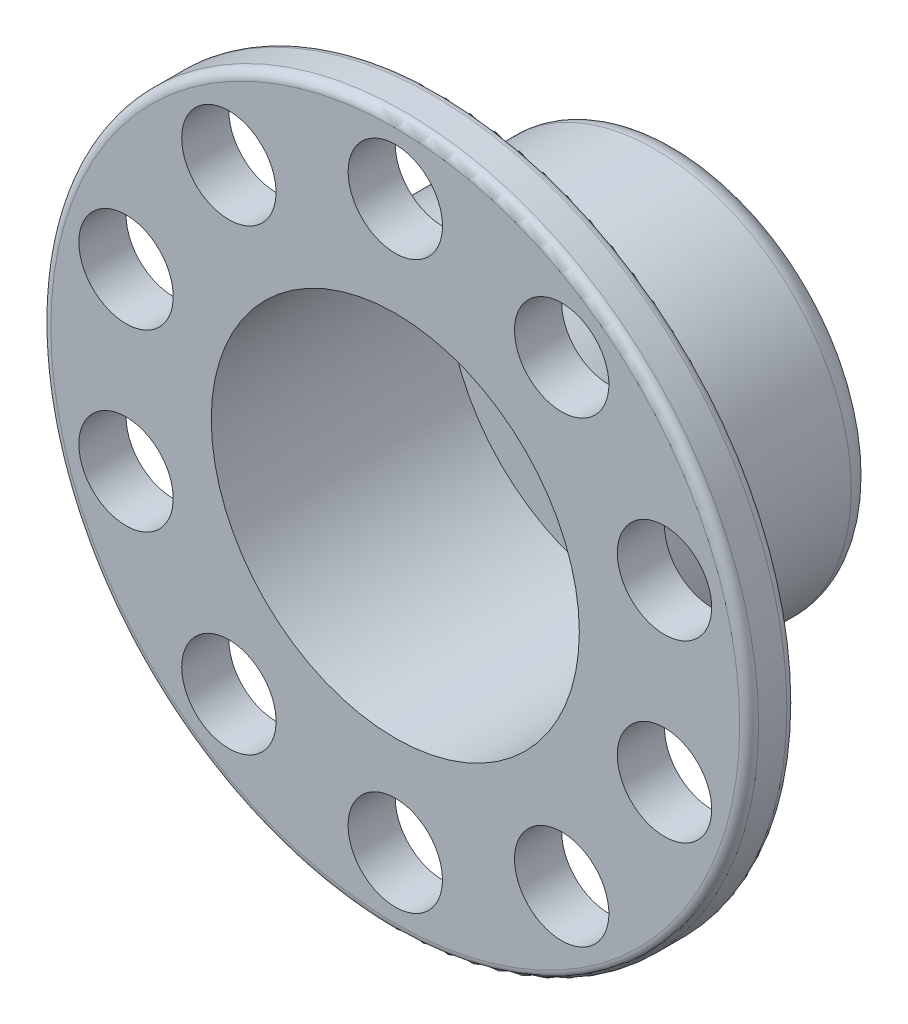
ISO-10303-21;
HEADER;
FILE_DESCRIPTION(('STEP AP214'),'2;1');
FILE_NAME('part.step','',(''),(''),'','','');
FILE_SCHEMA(('AUTOMOTIVE_DESIGN { 1 0 10303 214 1 1 1 1 }'));
ENDSEC;
DATA;
#1=APPLICATION_CONTEXT('core data for automotive mechanical design processes');
#2=APPLICATION_PROTOCOL_DEFINITION('international standard','automotive_design',2000,#1);
#3=PRODUCT_CONTEXT('',#1,'mechanical');
#4=PRODUCT('Part','Part','',(#3));
#5=PRODUCT_RELATED_PRODUCT_CATEGORY('part','',(#4));
#6=PRODUCT_DEFINITION_FORMATION('','',#4);
#7=PRODUCT_DEFINITION_CONTEXT('part definition',#1,'design');
#8=PRODUCT_DEFINITION('design','',#6,#7);
#9=PRODUCT_DEFINITION_SHAPE('','',#8);
#10=(LENGTH_UNIT() NAMED_UNIT(*) SI_UNIT(.MILLI.,.METRE.));
#11=(NAMED_UNIT(*) PLANE_ANGLE_UNIT() SI_UNIT($,.RADIAN.));
#12=(NAMED_UNIT(*) SI_UNIT($,.STERADIAN.) SOLID_ANGLE_UNIT());
#13=UNCERTAINTY_MEASURE_WITH_UNIT(LENGTH_MEASURE(1.E-05),#10,'distance_accuracy_value','');
#14=(GEOMETRIC_REPRESENTATION_CONTEXT(3) GLOBAL_UNCERTAINTY_ASSIGNED_CONTEXT((#13)) GLOBAL_UNIT_ASSIGNED_CONTEXT((#10,
#11,#12)) REPRESENTATION_CONTEXT('',''));
#15=CARTESIAN_POINT('',(0.,0.,0.));
#16=DIRECTION('',(0.,0.,1.));
#17=DIRECTION('',(1.,0.,0.));
#18=AXIS2_PLACEMENT_3D('',#15,#16,#17);
#19=CARTESIAN_POINT('',(0.,0.,-50.));
#20=DIRECTION('',(0.,0.,1.));
#21=DIRECTION('',(1.,0.,0.));
#22=AXIS2_PLACEMENT_3D('',#19,#20,#21);
#23=CYLINDRICAL_SURFACE('',#22,39.005);
#24=CARTESIAN_POINT('',(0.,0.,10.));
#25=DIRECTION('',(0.,0.,1.));
#26=DIRECTION('',(1.,0.,0.));
#27=AXIS2_PLACEMENT_3D('',#24,#25,#26);
#28=CIRCLE('',#27,39.005);
#29=CARTESIAN_POINT('',(39.005,0.,10.));
#30=VERTEX_POINT('',#29);
#31=EDGE_CURVE('E89',#30,#30,#28,.T.);
#32=ORIENTED_EDGE('',*,*,#31,.T.);
#33=EDGE_LOOP('',(#32));
#34=FACE_BOUND('',#33,.T.);
#35=CARTESIAN_POINT('',(0.,0.,-40.));
#36=DIRECTION('',(0.,0.,-1.));
#37=DIRECTION('',(-1.,0.,0.));
#38=AXIS2_PLACEMENT_3D('',#35,#36,#37);
#39=CIRCLE('',#38,39.005);
#40=CARTESIAN_POINT('',(-39.005,0.,-40.));
#41=VERTEX_POINT('',#40);
#42=EDGE_CURVE('E81',#41,#41,#39,.F.);
#43=ORIENTED_EDGE('',*,*,#42,.F.);
#44=EDGE_LOOP('',(#43));
#45=FACE_BOUND('',#44,.T.);
#46=ADVANCED_FACE('F49',(#34,#45),#23,.F.);
#47=CARTESIAN_POINT('',(0.,0.,10.));
#48=DIRECTION('',(0.,0.,1.));
#49=DIRECTION('',(1.,0.,0.));
#50=AXIS2_PLACEMENT_3D('',#47,#48,#49);
#51=PLANE('',#50);
#52=CARTESIAN_POINT('',(0.,0.,10.));
#53=DIRECTION('',(0.,0.,1.));
#54=DIRECTION('',(1.,0.,0.));
#55=AXIS2_PLACEMENT_3D('',#52,#53,#54);
#56=CIRCLE('',#55,73.);
#57=CARTESIAN_POINT('',(73.,0.,10.));
#58=VERTEX_POINT('',#57);
#59=EDGE_CURVE('E11',#58,#58,#56,.T.);
#60=ORIENTED_EDGE('',*,*,#59,.T.);
#61=EDGE_LOOP('',(#60));
#62=FACE_BOUND('',#61,.T.);
#63=CARTESIAN_POINT('',(-35.2671151375489,48.5410196624983,10.));
#64=DIRECTION('',(0.,0.,-1.));
#65=DIRECTION('',(-1.,0.,0.));
#66=AXIS2_PLACEMENT_3D('',#63,#64,#65);
#67=CIRCLE('',#66,10.0000000000001);
#68=CARTESIAN_POINT('',(-45.267115137549,48.5410196624983,10.));
#69=VERTEX_POINT('',#68);
#70=EDGE_CURVE('E98',#69,#69,#67,.T.);
#71=ORIENTED_EDGE('',*,*,#70,.T.);
#72=EDGE_LOOP('',(#71));
#73=FACE_BOUND('',#72,.T.);
#74=CARTESIAN_POINT('',(-57.063390977711,18.5410196624993,10.));
#75=DIRECTION('',(0.,0.,-1.));
#76=DIRECTION('',(-1.,0.,0.));
#77=AXIS2_PLACEMENT_3D('',#74,#75,#76);
#78=CIRCLE('',#77,10.0000000000011);
#79=CARTESIAN_POINT('',(-67.0633909777121,18.5410196624993,10.));
#80=VERTEX_POINT('',#79);
#81=EDGE_CURVE('E155',#80,#80,#78,.T.);
#82=ORIENTED_EDGE('',*,*,#81,.T.);
#83=EDGE_LOOP('',(#82));
#84=FACE_BOUND('',#83,.T.);
#85=CARTESIAN_POINT('',(-57.0633909777126,-18.5410196624944,10.));
#86=DIRECTION('',(0.,0.,-1.));
#87=DIRECTION('',(-1.,0.,0.));
#88=AXIS2_PLACEMENT_3D('',#85,#86,#87);
#89=CIRCLE('',#88,10.0000000000027);
#90=CARTESIAN_POINT('',(-67.0633909777153,-18.5410196624944,10.));
#91=VERTEX_POINT('',#90);
#92=EDGE_CURVE('E147',#91,#91,#89,.T.);
#93=ORIENTED_EDGE('',*,*,#92,.T.);
#94=EDGE_LOOP('',(#93));
#95=FACE_BOUND('',#94,.T.);
#96=CARTESIAN_POINT('',(-35.267115137553,-48.5410196624953,10.));
#97=DIRECTION('',(0.,0.,-1.));
#98=DIRECTION('',(-1.,0.,0.));
#99=AXIS2_PLACEMENT_3D('',#96,#97,#98);
#100=CIRCLE('',#99,10.0000000000043);
#101=CARTESIAN_POINT('',(-45.2671151375573,-48.5410196624953,10.));
#102=VERTEX_POINT('',#101);
#103=EDGE_CURVE('E139',#102,#102,#100,.T.);
#104=ORIENTED_EDGE('',*,*,#103,.T.);
#105=EDGE_LOOP('',(#104));
#106=FACE_BOUND('',#105,.T.);
#107=CARTESIAN_POINT('',(-5.10121193588295E-12,-60.,10.));
#108=DIRECTION('',(0.,0.,-1.));
#109=DIRECTION('',(-1.,0.,0.));
#110=AXIS2_PLACEMENT_3D('',#107,#108,#109);
#111=CIRCLE('',#110,10.0000000000053);
#112=CARTESIAN_POINT('',(-10.0000000000104,-60.,10.));
#113=VERTEX_POINT('',#112);
#114=EDGE_CURVE('E131',#113,#113,#111,.T.);
#115=ORIENTED_EDGE('',*,*,#114,.T.);
#116=EDGE_LOOP('',(#115));
#117=FACE_BOUND('',#116,.T.);
#118=CARTESIAN_POINT('',(35.2671151375438,-48.5410196624983,10.));
#119=DIRECTION('',(0.,0.,-1.));
#120=DIRECTION('',(-1.,0.,0.));
#121=AXIS2_PLACEMENT_3D('',#118,#119,#120);
#122=CIRCLE('',#121,10.0000000000054);
#123=CARTESIAN_POINT('',(25.2671151375384,-48.5410196624983,10.));
#124=VERTEX_POINT('',#123);
#125=EDGE_CURVE('E123',#124,#124,#122,.T.);
#126=ORIENTED_EDGE('',*,*,#125,.T.);
#127=EDGE_LOOP('',(#126));
#128=FACE_BOUND('',#127,.T.);
#129=CARTESIAN_POINT('',(57.0633909777059,-18.5410196624993,10.));
#130=DIRECTION('',(0.,0.,-1.));
#131=DIRECTION('',(-1.,0.,0.));
#132=AXIS2_PLACEMENT_3D('',#129,#130,#131);
#133=CIRCLE('',#132,10.0000000000044);
#134=CARTESIAN_POINT('',(47.0633909777014,-18.5410196624993,10.));
#135=VERTEX_POINT('',#134);
#136=EDGE_CURVE('E115',#135,#135,#133,.T.);
#137=ORIENTED_EDGE('',*,*,#136,.T.);
#138=EDGE_LOOP('',(#137));
#139=FACE_BOUND('',#138,.T.);
#140=CARTESIAN_POINT('',(57.0633909777075,18.5410196624944,10.));
#141=DIRECTION('',(0.,0.,-1.));
#142=DIRECTION('',(-1.,0.,0.));
#143=AXIS2_PLACEMENT_3D('',#140,#141,#142);
#144=CIRCLE('',#143,10.0000000000031);
#145=CARTESIAN_POINT('',(47.0633909777044,18.5410196624944,10.));
#146=VERTEX_POINT('',#145);
#147=EDGE_CURVE('E106',#146,#146,#144,.T.);
#148=ORIENTED_EDGE('',*,*,#147,.T.);
#149=EDGE_LOOP('',(#148));
#150=FACE_BOUND('',#149,.T.);
#151=CARTESIAN_POINT('',(35.2671151375479,48.5410196624953,10.));
#152=DIRECTION('',(0.,0.,-1.));
#153=DIRECTION('',(-1.,0.,0.));
#154=AXIS2_PLACEMENT_3D('',#151,#152,#153);
#155=CIRCLE('',#154,10.0000000000017);
#156=CARTESIAN_POINT('',(25.2671151375462,48.5410196624953,10.));
#157=VERTEX_POINT('',#156);
#158=EDGE_CURVE('E107',#157,#157,#155,.T.);
#159=ORIENTED_EDGE('',*,*,#158,.T.);
#160=EDGE_LOOP('',(#159));
#161=FACE_BOUND('',#160,.T.);
#162=CARTESIAN_POINT('',(0.,60.,10.));
#163=DIRECTION('',(0.,0.,-1.));
#164=DIRECTION('',(-1.,0.,0.));
#165=AXIS2_PLACEMENT_3D('',#162,#163,#164);
#166=CIRCLE('',#165,10.);
#167=CARTESIAN_POINT('',(-10.,60.,10.));
#168=VERTEX_POINT('',#167);
#169=EDGE_CURVE('E93',#168,#168,#166,.T.);
#170=ORIENTED_EDGE('',*,*,#169,.T.);
#171=EDGE_LOOP('',(#170));
#172=FACE_BOUND('',#171,.T.);
#173=ORIENTED_EDGE('',*,*,#31,.F.);
#174=EDGE_LOOP('',(#173));
#175=FACE_BOUND('',#174,.T.);
#176=ADVANCED_FACE('F174',(#62,#73,#84,#95,#106,#117,#128,#139,#150,#161,#172,#175),#51,.T.);
#177=CARTESIAN_POINT('',(0.,0.,0.));
#178=DIRECTION('',(0.,0.,1.));
#179=DIRECTION('',(1.,0.,0.));
#180=AXIS2_PLACEMENT_3D('',#177,#178,#179);
#181=PLANE('',#180);
#182=CARTESIAN_POINT('',(0.,0.,0.));
#183=DIRECTION('',(0.,0.,1.));
#184=DIRECTION('',(1.,0.,0.));
#185=AXIS2_PLACEMENT_3D('',#182,#183,#184);
#186=CIRCLE('',#185,73.);
#187=CARTESIAN_POINT('',(73.,0.,0.));
#188=VERTEX_POINT('',#187);
#189=EDGE_CURVE('E57',#188,#188,#186,.F.);
#190=ORIENTED_EDGE('',*,*,#189,.T.);
#191=EDGE_LOOP('',(#190));
#192=FACE_BOUND('',#191,.T.);
#193=CARTESIAN_POINT('',(-35.2671151375489,48.5410196624983,0.));
#194=DIRECTION('',(0.,0.,-1.));
#195=DIRECTION('',(-1.,0.,0.));
#196=AXIS2_PLACEMENT_3D('',#193,#194,#195);
#197=CIRCLE('',#196,10.0000000000001);
#198=CARTESIAN_POINT('',(-45.267115137549,48.5410196624983,0.));
#199=VERTEX_POINT('',#198);
#200=EDGE_CURVE('E159',#199,#199,#197,.T.);
#201=ORIENTED_EDGE('',*,*,#200,.F.);
#202=EDGE_LOOP('',(#201));
#203=FACE_BOUND('',#202,.T.);
#204=CARTESIAN_POINT('',(-57.063390977711,18.5410196624993,0.));
#205=DIRECTION('',(0.,0.,-1.));
#206=DIRECTION('',(-1.,0.,0.));
#207=AXIS2_PLACEMENT_3D('',#204,#205,#206);
#208=CIRCLE('',#207,10.0000000000011);
#209=CARTESIAN_POINT('',(-67.0633909777121,18.5410196624993,0.));
#210=VERTEX_POINT('',#209);
#211=EDGE_CURVE('E151',#210,#210,#208,.T.);
#212=ORIENTED_EDGE('',*,*,#211,.F.);
#213=EDGE_LOOP('',(#212));
#214=FACE_BOUND('',#213,.T.);
#215=CARTESIAN_POINT('',(-57.0633909777126,-18.5410196624944,0.));
#216=DIRECTION('',(0.,0.,-1.));
#217=DIRECTION('',(-1.,0.,0.));
#218=AXIS2_PLACEMENT_3D('',#215,#216,#217);
#219=CIRCLE('',#218,10.0000000000027);
#220=CARTESIAN_POINT('',(-67.0633909777153,-18.5410196624944,0.));
#221=VERTEX_POINT('',#220);
#222=EDGE_CURVE('E143',#221,#221,#219,.T.);
#223=ORIENTED_EDGE('',*,*,#222,.F.);
#224=EDGE_LOOP('',(#223));
#225=FACE_BOUND('',#224,.T.);
#226=CARTESIAN_POINT('',(-35.267115137553,-48.5410196624953,0.));
#227=DIRECTION('',(0.,0.,-1.));
#228=DIRECTION('',(-1.,0.,0.));
#229=AXIS2_PLACEMENT_3D('',#226,#227,#228);
#230=CIRCLE('',#229,10.0000000000043);
#231=CARTESIAN_POINT('',(-45.2671151375573,-48.5410196624953,0.));
#232=VERTEX_POINT('',#231);
#233=EDGE_CURVE('E135',#232,#232,#230,.T.);
#234=ORIENTED_EDGE('',*,*,#233,.F.);
#235=EDGE_LOOP('',(#234));
#236=FACE_BOUND('',#235,.T.);
#237=CARTESIAN_POINT('',(-5.10121193588295E-12,-60.,0.));
#238=DIRECTION('',(0.,0.,-1.));
#239=DIRECTION('',(-1.,0.,0.));
#240=AXIS2_PLACEMENT_3D('',#237,#238,#239);
#241=CIRCLE('',#240,10.0000000000053);
#242=CARTESIAN_POINT('',(-10.0000000000104,-60.,0.));
#243=VERTEX_POINT('',#242);
#244=EDGE_CURVE('E127',#243,#243,#241,.T.);
#245=ORIENTED_EDGE('',*,*,#244,.F.);
#246=EDGE_LOOP('',(#245));
#247=FACE_BOUND('',#246,.T.);
#248=CARTESIAN_POINT('',(35.2671151375438,-48.5410196624983,0.));
#249=DIRECTION('',(0.,0.,-1.));
#250=DIRECTION('',(-1.,0.,0.));
#251=AXIS2_PLACEMENT_3D('',#248,#249,#250);
#252=CIRCLE('',#251,10.0000000000054);
#253=CARTESIAN_POINT('',(25.2671151375384,-48.5410196624983,0.));
#254=VERTEX_POINT('',#253);
#255=EDGE_CURVE('E119',#254,#254,#252,.T.);
#256=ORIENTED_EDGE('',*,*,#255,.F.);
#257=EDGE_LOOP('',(#256));
#258=FACE_BOUND('',#257,.T.);
#259=CARTESIAN_POINT('',(57.0633909777059,-18.5410196624993,0.));
#260=DIRECTION('',(0.,0.,-1.));
#261=DIRECTION('',(-1.,0.,0.));
#262=AXIS2_PLACEMENT_3D('',#259,#260,#261);
#263=CIRCLE('',#262,10.0000000000044);
#264=CARTESIAN_POINT('',(47.0633909777014,-18.5410196624993,0.));
#265=VERTEX_POINT('',#264);
#266=EDGE_CURVE('E111',#265,#265,#263,.T.);
#267=ORIENTED_EDGE('',*,*,#266,.F.);
#268=EDGE_LOOP('',(#267));
#269=FACE_BOUND('',#268,.T.);
#270=CARTESIAN_POINT('',(57.0633909777075,18.5410196624944,0.));
#271=DIRECTION('',(0.,0.,-1.));
#272=DIRECTION('',(-1.,0.,0.));
#273=AXIS2_PLACEMENT_3D('',#270,#271,#272);
#274=CIRCLE('',#273,10.0000000000031);
#275=CARTESIAN_POINT('',(47.0633909777044,18.5410196624944,0.));
#276=VERTEX_POINT('',#275);
#277=EDGE_CURVE('E102',#276,#276,#274,.T.);
#278=ORIENTED_EDGE('',*,*,#277,.F.);
#279=EDGE_LOOP('',(#278));
#280=FACE_BOUND('',#279,.T.);
#281=CARTESIAN_POINT('',(35.2671151375479,48.5410196624953,0.));
#282=DIRECTION('',(0.,0.,-1.));
#283=DIRECTION('',(-1.,0.,0.));
#284=AXIS2_PLACEMENT_3D('',#281,#282,#283);
#285=CIRCLE('',#284,10.0000000000017);
#286=CARTESIAN_POINT('',(25.2671151375462,48.5410196624953,0.));
#287=VERTEX_POINT('',#286);
#288=EDGE_CURVE('E166',#287,#287,#285,.T.);
#289=ORIENTED_EDGE('',*,*,#288,.F.);
#290=EDGE_LOOP('',(#289));
#291=FACE_BOUND('',#290,.T.);
#292=CARTESIAN_POINT('',(0.,60.,0.));
#293=DIRECTION('',(0.,0.,-1.));
#294=DIRECTION('',(-1.,0.,0.));
#295=AXIS2_PLACEMENT_3D('',#292,#293,#294);
#296=CIRCLE('',#295,10.);
#297=CARTESIAN_POINT('',(-10.,60.,0.));
#298=VERTEX_POINT('',#297);
#299=EDGE_CURVE('E94',#298,#298,#296,.T.);
#300=ORIENTED_EDGE('',*,*,#299,.F.);
#301=EDGE_LOOP('',(#300));
#302=FACE_BOUND('',#301,.T.);
#303=CARTESIAN_POINT('',(0.,0.,0.));
#304=DIRECTION('',(0.,0.,1.));
#305=DIRECTION('',(1.,0.,0.));
#306=AXIS2_PLACEMENT_3D('',#303,#304,#305);
#307=CIRCLE('',#306,41.655);
#308=CARTESIAN_POINT('',(41.655,0.,0.));
#309=VERTEX_POINT('',#308);
#310=EDGE_CURVE('E85',#309,#309,#307,.T.);
#311=ORIENTED_EDGE('',*,*,#310,.T.);
#312=EDGE_LOOP('',(#311));
#313=FACE_BOUND('',#312,.T.);
#314=ADVANCED_FACE('F185',(#192,#203,#214,#225,#236,#247,#258,#269,#280,#291,#302,#313),#181,.F.);
#315=CARTESIAN_POINT('',(0.,0.,10.));
#316=DIRECTION('',(0.,0.,-1.));
#317=DIRECTION('',(-1.,0.,0.));
#318=AXIS2_PLACEMENT_3D('',#315,#316,#317);
#319=CYLINDRICAL_SURFACE('',#318,75.);
#320=CARTESIAN_POINT('',(0.,0.,2.));
#321=DIRECTION('',(0.,0.,1.));
#322=DIRECTION('',(1.,0.,0.));
#323=AXIS2_PLACEMENT_3D('',#320,#321,#322);
#324=CIRCLE('',#323,75.);
#325=CARTESIAN_POINT('',(75.,0.,2.));
#326=VERTEX_POINT('',#325);
#327=EDGE_CURVE('E62',#326,#326,#324,.T.);
#328=ORIENTED_EDGE('',*,*,#327,.T.);
#329=EDGE_LOOP('',(#328));
#330=FACE_BOUND('',#329,.T.);
#331=CARTESIAN_POINT('',(0.,0.,8.));
#332=DIRECTION('',(0.,0.,1.));
#333=DIRECTION('',(1.,0.,0.));
#334=AXIS2_PLACEMENT_3D('',#331,#332,#333);
#335=CIRCLE('',#334,75.);
#336=CARTESIAN_POINT('',(75.,0.,8.));
#337=VERTEX_POINT('',#336);
#338=EDGE_CURVE('E67',#337,#337,#335,.F.);
#339=ORIENTED_EDGE('',*,*,#338,.T.);
#340=EDGE_LOOP('',(#339));
#341=FACE_BOUND('',#340,.T.);
#342=ADVANCED_FACE('F188',(#330,#341),#319,.T.);
#343=CARTESIAN_POINT('',(0.,0.,-50.));
#344=DIRECTION('',(0.,0.,1.));
#345=DIRECTION('',(1.,0.,0.));
#346=AXIS2_PLACEMENT_3D('',#343,#344,#345);
#347=CYLINDRICAL_SURFACE('',#346,41.655);
#348=CARTESIAN_POINT('',(0.,0.,-45.));
#349=DIRECTION('',(0.,0.,1.));
#350=DIRECTION('',(1.,0.,0.));
#351=AXIS2_PLACEMENT_3D('',#348,#349,#350);
#352=CIRCLE('',#351,41.655);
#353=CARTESIAN_POINT('',(41.655,0.,-45.));
#354=VERTEX_POINT('',#353);
#355=EDGE_CURVE('E77',#354,#354,#352,.T.);
#356=ORIENTED_EDGE('',*,*,#355,.T.);
#357=EDGE_LOOP('',(#356));
#358=FACE_BOUND('',#357,.T.);
#359=ORIENTED_EDGE('',*,*,#310,.F.);
#360=EDGE_LOOP('',(#359));
#361=FACE_BOUND('',#360,.T.);
#362=ADVANCED_FACE('F194',(#358,#361),#347,.T.);
#363=CARTESIAN_POINT('',(0.,0.,-50.));
#364=DIRECTION('',(0.,0.,1.));
#365=DIRECTION('',(1.,0.,0.));
#366=AXIS2_PLACEMENT_3D('',#363,#364,#365);
#367=PLANE('',#366);
#368=CARTESIAN_POINT('',(0.,0.,-50.));
#369=DIRECTION('',(0.,0.,1.));
#370=DIRECTION('',(1.,0.,0.));
#371=AXIS2_PLACEMENT_3D('',#368,#369,#370);
#372=CIRCLE('',#371,36.655);
#373=CARTESIAN_POINT('',(36.655,0.,-50.));
#374=VERTEX_POINT('',#373);
#375=EDGE_CURVE('E73',#374,#374,#372,.F.);
#376=ORIENTED_EDGE('',*,*,#375,.T.);
#377=EDGE_LOOP('',(#376));
#378=FACE_BOUND('',#377,.T.);
#379=ADVANCED_FACE('F196',(#378),#367,.F.);
#380=CARTESIAN_POINT('',(0.,0.,-40.));
#381=DIRECTION('',(0.,0.,-1.));
#382=DIRECTION('',(-1.,0.,0.));
#383=AXIS2_PLACEMENT_3D('',#380,#381,#382);
#384=PLANE('',#383);
#385=ORIENTED_EDGE('',*,*,#42,.T.);
#386=EDGE_LOOP('',(#385));
#387=FACE_BOUND('',#386,.T.);
#388=ADVANCED_FACE('F203',(#387),#384,.F.);
#389=CARTESIAN_POINT('',(0.,60.,10.));
#390=DIRECTION('',(0.,0.,-1.));
#391=DIRECTION('',(-1.,0.,0.));
#392=AXIS2_PLACEMENT_3D('',#389,#390,#391);
#393=CYLINDRICAL_SURFACE('',#392,10.);
#394=ORIENTED_EDGE('',*,*,#169,.F.);
#395=EDGE_LOOP('',(#394));
#396=FACE_BOUND('',#395,.T.);
#397=ORIENTED_EDGE('',*,*,#299,.T.);
#398=EDGE_LOOP('',(#397));
#399=FACE_BOUND('',#398,.T.);
#400=ADVANCED_FACE('F181',(#396,#399),#393,.F.);
#401=CARTESIAN_POINT('',(35.2671151375479,48.5410196624953,10.));
#402=DIRECTION('',(0.,0.,-1.));
#403=DIRECTION('',(-1.,0.,0.));
#404=AXIS2_PLACEMENT_3D('',#401,#402,#403);
#405=CYLINDRICAL_SURFACE('',#404,10.0000000000017);
#406=ORIENTED_EDGE('',*,*,#158,.F.);
#407=EDGE_LOOP('',(#406));
#408=FACE_BOUND('',#407,.T.);
#409=ORIENTED_EDGE('',*,*,#288,.T.);
#410=EDGE_LOOP('',(#409));
#411=FACE_BOUND('',#410,.T.);
#412=ADVANCED_FACE('F177',(#408,#411),#405,.F.);
#413=CARTESIAN_POINT('',(57.0633909777075,18.5410196624944,10.));
#414=DIRECTION('',(0.,0.,-1.));
#415=DIRECTION('',(-1.,0.,0.));
#416=AXIS2_PLACEMENT_3D('',#413,#414,#415);
#417=CYLINDRICAL_SURFACE('',#416,10.0000000000031);
#418=ORIENTED_EDGE('',*,*,#147,.F.);
#419=EDGE_LOOP('',(#418));
#420=FACE_BOUND('',#419,.T.);
#421=ORIENTED_EDGE('',*,*,#277,.T.);
#422=EDGE_LOOP('',(#421));
#423=FACE_BOUND('',#422,.T.);
#424=ADVANCED_FACE('F180',(#420,#423),#417,.F.);
#425=CARTESIAN_POINT('',(57.0633909777059,-18.5410196624993,10.));
#426=DIRECTION('',(0.,0.,-1.));
#427=DIRECTION('',(-1.,0.,0.));
#428=AXIS2_PLACEMENT_3D('',#425,#426,#427);
#429=CYLINDRICAL_SURFACE('',#428,10.0000000000044);
#430=ORIENTED_EDGE('',*,*,#136,.F.);
#431=EDGE_LOOP('',(#430));
#432=FACE_BOUND('',#431,.T.);
#433=ORIENTED_EDGE('',*,*,#266,.T.);
#434=EDGE_LOOP('',(#433));
#435=FACE_BOUND('',#434,.T.);
#436=ADVANCED_FACE('F225',(#432,#435),#429,.F.);
#437=CARTESIAN_POINT('',(35.2671151375438,-48.5410196624983,10.));
#438=DIRECTION('',(0.,0.,-1.));
#439=DIRECTION('',(-1.,0.,0.));
#440=AXIS2_PLACEMENT_3D('',#437,#438,#439);
#441=CYLINDRICAL_SURFACE('',#440,10.0000000000054);
#442=ORIENTED_EDGE('',*,*,#125,.F.);
#443=EDGE_LOOP('',(#442));
#444=FACE_BOUND('',#443,.T.);
#445=ORIENTED_EDGE('',*,*,#255,.T.);
#446=EDGE_LOOP('',(#445));
#447=FACE_BOUND('',#446,.T.);
#448=ADVANCED_FACE('F229',(#444,#447),#441,.F.);
#449=CARTESIAN_POINT('',(-5.10121193588295E-12,-60.,10.));
#450=DIRECTION('',(0.,0.,-1.));
#451=DIRECTION('',(-1.,0.,0.));
#452=AXIS2_PLACEMENT_3D('',#449,#450,#451);
#453=CYLINDRICAL_SURFACE('',#452,10.0000000000053);
#454=ORIENTED_EDGE('',*,*,#114,.F.);
#455=EDGE_LOOP('',(#454));
#456=FACE_BOUND('',#455,.T.);
#457=ORIENTED_EDGE('',*,*,#244,.T.);
#458=EDGE_LOOP('',(#457));
#459=FACE_BOUND('',#458,.T.);
#460=ADVANCED_FACE('F233',(#456,#459),#453,.F.);
#461=CARTESIAN_POINT('',(-35.267115137553,-48.5410196624953,10.));
#462=DIRECTION('',(0.,0.,-1.));
#463=DIRECTION('',(-1.,0.,0.));
#464=AXIS2_PLACEMENT_3D('',#461,#462,#463);
#465=CYLINDRICAL_SURFACE('',#464,10.0000000000043);
#466=ORIENTED_EDGE('',*,*,#103,.F.);
#467=EDGE_LOOP('',(#466));
#468=FACE_BOUND('',#467,.T.);
#469=ORIENTED_EDGE('',*,*,#233,.T.);
#470=EDGE_LOOP('',(#469));
#471=FACE_BOUND('',#470,.T.);
#472=ADVANCED_FACE('F237',(#468,#471),#465,.F.);
#473=CARTESIAN_POINT('',(-57.0633909777126,-18.5410196624944,10.));
#474=DIRECTION('',(0.,0.,-1.));
#475=DIRECTION('',(-1.,0.,0.));
#476=AXIS2_PLACEMENT_3D('',#473,#474,#475);
#477=CYLINDRICAL_SURFACE('',#476,10.0000000000027);
#478=ORIENTED_EDGE('',*,*,#92,.F.);
#479=EDGE_LOOP('',(#478));
#480=FACE_BOUND('',#479,.T.);
#481=ORIENTED_EDGE('',*,*,#222,.T.);
#482=EDGE_LOOP('',(#481));
#483=FACE_BOUND('',#482,.T.);
#484=ADVANCED_FACE('F241',(#480,#483),#477,.F.);
#485=CARTESIAN_POINT('',(-57.063390977711,18.5410196624993,10.));
#486=DIRECTION('',(0.,0.,-1.));
#487=DIRECTION('',(-1.,0.,0.));
#488=AXIS2_PLACEMENT_3D('',#485,#486,#487);
#489=CYLINDRICAL_SURFACE('',#488,10.0000000000011);
#490=ORIENTED_EDGE('',*,*,#81,.F.);
#491=EDGE_LOOP('',(#490));
#492=FACE_BOUND('',#491,.T.);
#493=ORIENTED_EDGE('',*,*,#211,.T.);
#494=EDGE_LOOP('',(#493));
#495=FACE_BOUND('',#494,.T.);
#496=ADVANCED_FACE('F245',(#492,#495),#489,.F.);
#497=CARTESIAN_POINT('',(-35.2671151375489,48.5410196624983,10.));
#498=DIRECTION('',(0.,0.,-1.));
#499=DIRECTION('',(-1.,0.,0.));
#500=AXIS2_PLACEMENT_3D('',#497,#498,#499);
#501=CYLINDRICAL_SURFACE('',#500,10.0000000000001);
#502=ORIENTED_EDGE('',*,*,#70,.F.);
#503=EDGE_LOOP('',(#502));
#504=FACE_BOUND('',#503,.T.);
#505=ORIENTED_EDGE('',*,*,#200,.T.);
#506=EDGE_LOOP('',(#505));
#507=FACE_BOUND('',#506,.T.);
#508=ADVANCED_FACE('F249',(#504,#507),#501,.F.);
#509=CARTESIAN_POINT('',(0.,0.,-45.));
#510=DIRECTION('',(0.,0.,1.));
#511=DIRECTION('',(1.,0.,0.));
#512=AXIS2_PLACEMENT_3D('',#509,#510,#511);
#513=TOROIDAL_SURFACE('',#512,36.655,5.);
#514=ORIENTED_EDGE('',*,*,#375,.F.);
#515=EDGE_LOOP('',(#514));
#516=FACE_BOUND('',#515,.T.);
#517=ORIENTED_EDGE('',*,*,#355,.F.);
#518=EDGE_LOOP('',(#517));
#519=FACE_BOUND('',#518,.T.);
#520=ADVANCED_FACE('F252',(#516,#519),#513,.T.);
#521=CARTESIAN_POINT('',(0.,0.,2.));
#522=DIRECTION('',(0.,0.,1.));
#523=DIRECTION('',(1.,0.,0.));
#524=AXIS2_PLACEMENT_3D('',#521,#522,#523);
#525=TOROIDAL_SURFACE('',#524,73.,2.);
#526=ORIENTED_EDGE('',*,*,#189,.F.);
#527=EDGE_LOOP('',(#526));
#528=FACE_BOUND('',#527,.T.);
#529=ORIENTED_EDGE('',*,*,#327,.F.);
#530=EDGE_LOOP('',(#529));
#531=FACE_BOUND('',#530,.T.);
#532=ADVANCED_FACE('F257',(#528,#531),#525,.T.);
#533=CARTESIAN_POINT('',(0.,0.,8.));
#534=DIRECTION('',(0.,0.,1.));
#535=DIRECTION('',(1.,0.,0.));
#536=AXIS2_PLACEMENT_3D('',#533,#534,#535);
#537=TOROIDAL_SURFACE('',#536,73.,2.);
#538=ORIENTED_EDGE('',*,*,#338,.F.);
#539=EDGE_LOOP('',(#538));
#540=FACE_BOUND('',#539,.T.);
#541=ORIENTED_EDGE('',*,*,#59,.F.);
#542=EDGE_LOOP('',(#541));
#543=FACE_BOUND('',#542,.T.);
#544=ADVANCED_FACE('F51',(#540,#543),#537,.T.);
#545=CLOSED_SHELL('',(#46,#176,#314,#342,#362,#379,#388,#400,#412,#424,#436,#448,#460,#472,#484,
#496,#508,#520,#532,#544));
#546=MANIFOLD_SOLID_BREP('B2',#545);
#547=ADVANCED_BREP_SHAPE_REPRESENTATION('',(#18,#546),#14);
#548=SHAPE_DEFINITION_REPRESENTATION(#9,#547);
ENDSEC;
END-ISO-10303-21;
